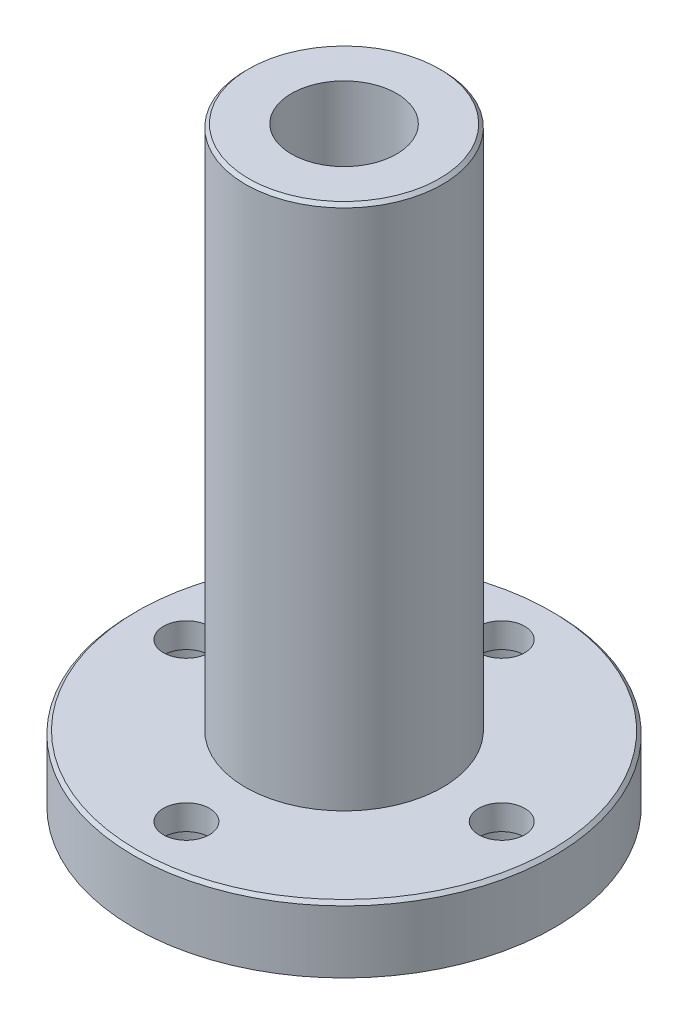
ISO-10303-21;
HEADER;
FILE_DESCRIPTION(('STEP AP214'),'2;1');
FILE_NAME('part.step','',(''),(''),'','','');
FILE_SCHEMA(('AUTOMOTIVE_DESIGN { 1 0 10303 214 1 1 1 1 }'));
ENDSEC;
DATA;
#1=APPLICATION_CONTEXT('core data for automotive mechanical design processes');
#2=APPLICATION_PROTOCOL_DEFINITION('international standard','automotive_design',2000,#1);
#3=PRODUCT_CONTEXT('',#1,'mechanical');
#4=PRODUCT('Part','Part','',(#3));
#5=PRODUCT_RELATED_PRODUCT_CATEGORY('part','',(#4));
#6=PRODUCT_DEFINITION_FORMATION('','',#4);
#7=PRODUCT_DEFINITION_CONTEXT('part definition',#1,'design');
#8=PRODUCT_DEFINITION('design','',#6,#7);
#9=PRODUCT_DEFINITION_SHAPE('','',#8);
#10=(LENGTH_UNIT() NAMED_UNIT(*) SI_UNIT(.MILLI.,.METRE.));
#11=(NAMED_UNIT(*) PLANE_ANGLE_UNIT() SI_UNIT($,.RADIAN.));
#12=(NAMED_UNIT(*) SI_UNIT($,.STERADIAN.) SOLID_ANGLE_UNIT());
#13=UNCERTAINTY_MEASURE_WITH_UNIT(LENGTH_MEASURE(1.E-05),#10,'distance_accuracy_value','');
#14=(GEOMETRIC_REPRESENTATION_CONTEXT(3) GLOBAL_UNCERTAINTY_ASSIGNED_CONTEXT((#13)) GLOBAL_UNIT_ASSIGNED_CONTEXT((#10,
#11,#12)) REPRESENTATION_CONTEXT('',''));
#15=CARTESIAN_POINT('',(0.,0.,0.));
#16=DIRECTION('',(0.,0.,1.));
#17=DIRECTION('',(1.,0.,0.));
#18=AXIS2_PLACEMENT_3D('',#15,#16,#17);
#19=CARTESIAN_POINT('',(0.,0.,-12.));
#20=DIRECTION('',(0.,1.,0.));
#21=DIRECTION('',(0.,0.,1.));
#22=AXIS2_PLACEMENT_3D('',#19,#20,#21);
#23=CYLINDRICAL_SURFACE('',#22,1.75);
#24=CARTESIAN_POINT('',(0.,5.,-12.));
#25=DIRECTION('',(0.,1.,0.));
#26=DIRECTION('',(0.,0.,1.));
#27=AXIS2_PLACEMENT_3D('',#24,#25,#26);
#28=CIRCLE('',#27,1.75);
#29=CARTESIAN_POINT('',(0.,5.,-10.25));
#30=VERTEX_POINT('',#29);
#31=EDGE_CURVE('E73',#30,#30,#28,.T.);
#32=ORIENTED_EDGE('',*,*,#31,.T.);
#33=EDGE_LOOP('',(#32));
#34=FACE_BOUND('',#33,.T.);
#35=CARTESIAN_POINT('',(0.,3.1,-12.));
#36=DIRECTION('',(0.,-1.,0.));
#37=DIRECTION('',(0.,0.,-1.));
#38=AXIS2_PLACEMENT_3D('',#35,#36,#37);
#39=CIRCLE('',#38,1.75);
#40=CARTESIAN_POINT('',(0.,3.1,-13.75));
#41=VERTEX_POINT('',#40);
#42=EDGE_CURVE('E52',#41,#41,#39,.F.);
#43=ORIENTED_EDGE('',*,*,#42,.F.);
#44=EDGE_LOOP('',(#43));
#45=FACE_BOUND('',#44,.T.);
#46=ADVANCED_FACE('F31',(#34,#45),#23,.F.);
#47=CARTESIAN_POINT('',(12.,0.,0.));
#48=DIRECTION('',(0.,1.,0.));
#49=DIRECTION('',(0.,0.,1.));
#50=AXIS2_PLACEMENT_3D('',#47,#48,#49);
#51=CYLINDRICAL_SURFACE('',#50,1.75);
#52=CARTESIAN_POINT('',(12.,5.,0.));
#53=DIRECTION('',(0.,1.,0.));
#54=DIRECTION('',(0.,0.,1.));
#55=AXIS2_PLACEMENT_3D('',#52,#53,#54);
#56=CIRCLE('',#55,1.75);
#57=CARTESIAN_POINT('',(12.,5.,1.75));
#58=VERTEX_POINT('',#57);
#59=EDGE_CURVE('E80',#58,#58,#56,.T.);
#60=ORIENTED_EDGE('',*,*,#59,.T.);
#61=EDGE_LOOP('',(#60));
#62=FACE_BOUND('',#61,.T.);
#63=CARTESIAN_POINT('',(12.,3.1,0.));
#64=DIRECTION('',(0.,-1.,0.));
#65=DIRECTION('',(0.,0.,-1.));
#66=AXIS2_PLACEMENT_3D('',#63,#64,#65);
#67=CIRCLE('',#66,1.75);
#68=CARTESIAN_POINT('',(12.,3.1,-1.75));
#69=VERTEX_POINT('',#68);
#70=EDGE_CURVE('E56',#69,#69,#67,.F.);
#71=ORIENTED_EDGE('',*,*,#70,.F.);
#72=EDGE_LOOP('',(#71));
#73=FACE_BOUND('',#72,.T.);
#74=ADVANCED_FACE('F153',(#62,#73),#51,.F.);
#75=CARTESIAN_POINT('',(-12.,0.,0.));
#76=DIRECTION('',(0.,1.,0.));
#77=DIRECTION('',(0.,0.,1.));
#78=AXIS2_PLACEMENT_3D('',#75,#76,#77);
#79=CYLINDRICAL_SURFACE('',#78,1.75);
#80=CARTESIAN_POINT('',(-12.,5.,0.));
#81=DIRECTION('',(0.,1.,0.));
#82=DIRECTION('',(0.,0.,1.));
#83=AXIS2_PLACEMENT_3D('',#80,#81,#82);
#84=CIRCLE('',#83,1.75);
#85=CARTESIAN_POINT('',(-12.,5.,1.75));
#86=VERTEX_POINT('',#85);
#87=EDGE_CURVE('E76',#86,#86,#84,.T.);
#88=ORIENTED_EDGE('',*,*,#87,.T.);
#89=EDGE_LOOP('',(#88));
#90=FACE_BOUND('',#89,.T.);
#91=CARTESIAN_POINT('',(-12.,3.1,0.));
#92=DIRECTION('',(0.,-1.,0.));
#93=DIRECTION('',(0.,0.,-1.));
#94=AXIS2_PLACEMENT_3D('',#91,#92,#93);
#95=CIRCLE('',#94,1.75);
#96=CARTESIAN_POINT('',(-12.,3.1,-1.75));
#97=VERTEX_POINT('',#96);
#98=EDGE_CURVE('E59',#97,#97,#95,.F.);
#99=ORIENTED_EDGE('',*,*,#98,.F.);
#100=EDGE_LOOP('',(#99));
#101=FACE_BOUND('',#100,.T.);
#102=ADVANCED_FACE('F149',(#90,#101),#79,.F.);
#103=CARTESIAN_POINT('',(0.,0.,12.));
#104=DIRECTION('',(0.,1.,0.));
#105=DIRECTION('',(0.,0.,1.));
#106=AXIS2_PLACEMENT_3D('',#103,#104,#105);
#107=CYLINDRICAL_SURFACE('',#106,1.75);
#108=CARTESIAN_POINT('',(0.,5.,12.));
#109=DIRECTION('',(0.,1.,0.));
#110=DIRECTION('',(0.,0.,1.));
#111=AXIS2_PLACEMENT_3D('',#108,#109,#110);
#112=CIRCLE('',#111,1.75);
#113=CARTESIAN_POINT('',(0.,5.,13.75));
#114=VERTEX_POINT('',#113);
#115=EDGE_CURVE('E77',#114,#114,#112,.T.);
#116=ORIENTED_EDGE('',*,*,#115,.T.);
#117=EDGE_LOOP('',(#116));
#118=FACE_BOUND('',#117,.T.);
#119=CARTESIAN_POINT('',(0.,3.1,12.));
#120=DIRECTION('',(0.,-1.,0.));
#121=DIRECTION('',(0.,0.,-1.));
#122=AXIS2_PLACEMENT_3D('',#119,#120,#121);
#123=CIRCLE('',#122,1.75);
#124=CARTESIAN_POINT('',(0.,3.1,10.25));
#125=VERTEX_POINT('',#124);
#126=EDGE_CURVE('E63',#125,#125,#123,.F.);
#127=ORIENTED_EDGE('',*,*,#126,.F.);
#128=EDGE_LOOP('',(#127));
#129=FACE_BOUND('',#128,.T.);
#130=ADVANCED_FACE('F140',(#118,#129),#107,.F.);
#131=CARTESIAN_POINT('',(0.,5.,0.));
#132=DIRECTION('',(0.,-1.,0.));
#133=DIRECTION('',(0.,0.,-1.));
#134=AXIS2_PLACEMENT_3D('',#131,#132,#133);
#135=CYLINDRICAL_SURFACE('',#134,16.);
#136=CARTESIAN_POINT('',(0.,4.75000000000001,0.));
#137=DIRECTION('',(0.,1.,0.));
#138=DIRECTION('',(0.,0.,1.));
#139=AXIS2_PLACEMENT_3D('',#136,#137,#138);
#140=CIRCLE('',#139,16.);
#141=CARTESIAN_POINT('',(0.,4.75000000000001,16.));
#142=VERTEX_POINT('',#141);
#143=EDGE_CURVE('E42',#142,#142,#140,.F.);
#144=ORIENTED_EDGE('',*,*,#143,.T.);
#145=EDGE_LOOP('',(#144));
#146=FACE_BOUND('',#145,.T.);
#147=CARTESIAN_POINT('',(0.,0.,0.));
#148=DIRECTION('',(0.,1.,0.));
#149=DIRECTION('',(0.,0.,1.));
#150=AXIS2_PLACEMENT_3D('',#147,#148,#149);
#151=CIRCLE('',#150,16.);
#152=CARTESIAN_POINT('',(0.,0.,16.));
#153=VERTEX_POINT('',#152);
#154=EDGE_CURVE('E51',#153,#153,#151,.T.);
#155=ORIENTED_EDGE('',*,*,#154,.T.);
#156=EDGE_LOOP('',(#155));
#157=FACE_BOUND('',#156,.T.);
#158=ADVANCED_FACE('F138',(#146,#157),#135,.T.);
#159=CARTESIAN_POINT('',(0.,5.,0.));
#160=DIRECTION('',(0.,1.,0.));
#161=DIRECTION('',(0.,0.,1.));
#162=AXIS2_PLACEMENT_3D('',#159,#160,#161);
#163=PLANE('',#162);
#164=CARTESIAN_POINT('',(0.,5.,0.));
#165=DIRECTION('',(0.,1.,0.));
#166=DIRECTION('',(0.,0.,1.));
#167=AXIS2_PLACEMENT_3D('',#164,#165,#166);
#168=CIRCLE('',#167,15.75);
#169=CARTESIAN_POINT('',(0.,5.,15.75));
#170=VERTEX_POINT('',#169);
#171=EDGE_CURVE('E46',#170,#170,#168,.T.);
#172=ORIENTED_EDGE('',*,*,#171,.T.);
#173=EDGE_LOOP('',(#172));
#174=FACE_BOUND('',#173,.T.);
#175=ORIENTED_EDGE('',*,*,#87,.F.);
#176=EDGE_LOOP('',(#175));
#177=FACE_BOUND('',#176,.T.);
#178=ORIENTED_EDGE('',*,*,#59,.F.);
#179=EDGE_LOOP('',(#178));
#180=FACE_BOUND('',#179,.T.);
#181=ORIENTED_EDGE('',*,*,#115,.F.);
#182=EDGE_LOOP('',(#181));
#183=FACE_BOUND('',#182,.T.);
#184=ORIENTED_EDGE('',*,*,#31,.F.);
#185=EDGE_LOOP('',(#184));
#186=FACE_BOUND('',#185,.T.);
#187=CARTESIAN_POINT('',(0.,5.,0.));
#188=DIRECTION('',(0.,1.,0.));
#189=DIRECTION('',(0.,0.,1.));
#190=AXIS2_PLACEMENT_3D('',#187,#188,#189);
#191=CIRCLE('',#190,7.5);
#192=CARTESIAN_POINT('',(0.,5.,7.5));
#193=VERTEX_POINT('',#192);
#194=EDGE_CURVE('E70',#193,#193,#191,.T.);
#195=ORIENTED_EDGE('',*,*,#194,.F.);
#196=EDGE_LOOP('',(#195));
#197=FACE_BOUND('',#196,.T.);
#198=ADVANCED_FACE('F126',(#174,#177,#180,#183,#186,#197),#163,.T.);
#199=CARTESIAN_POINT('',(0.,0.,0.));
#200=DIRECTION('',(0.,1.,0.));
#201=DIRECTION('',(0.,0.,1.));
#202=AXIS2_PLACEMENT_3D('',#199,#200,#201);
#203=PLANE('',#202);
#204=CARTESIAN_POINT('',(-12.,0.,0.));
#205=DIRECTION('',(0.,-1.,0.));
#206=DIRECTION('',(0.,0.,-1.));
#207=AXIS2_PLACEMENT_3D('',#204,#205,#206);
#208=CIRCLE('',#207,3.);
#209=CARTESIAN_POINT('',(-12.,0.,-3.));
#210=VERTEX_POINT('',#209);
#211=EDGE_CURVE('E106',#210,#210,#208,.T.);
#212=ORIENTED_EDGE('',*,*,#211,.F.);
#213=EDGE_LOOP('',(#212));
#214=FACE_BOUND('',#213,.T.);
#215=CARTESIAN_POINT('',(0.,0.,-12.));
#216=DIRECTION('',(0.,-1.,0.));
#217=DIRECTION('',(0.,0.,-1.));
#218=AXIS2_PLACEMENT_3D('',#215,#216,#217);
#219=CIRCLE('',#218,3.);
#220=CARTESIAN_POINT('',(0.,0.,-15.));
#221=VERTEX_POINT('',#220);
#222=EDGE_CURVE('E100',#221,#221,#219,.T.);
#223=ORIENTED_EDGE('',*,*,#222,.F.);
#224=EDGE_LOOP('',(#223));
#225=FACE_BOUND('',#224,.T.);
#226=CARTESIAN_POINT('',(12.,0.,0.));
#227=DIRECTION('',(0.,-1.,0.));
#228=DIRECTION('',(0.,0.,-1.));
#229=AXIS2_PLACEMENT_3D('',#226,#227,#228);
#230=CIRCLE('',#229,3.);
#231=CARTESIAN_POINT('',(12.,0.,-3.));
#232=VERTEX_POINT('',#231);
#233=EDGE_CURVE('E94',#232,#232,#230,.T.);
#234=ORIENTED_EDGE('',*,*,#233,.F.);
#235=EDGE_LOOP('',(#234));
#236=FACE_BOUND('',#235,.T.);
#237=CARTESIAN_POINT('',(0.,0.,12.));
#238=DIRECTION('',(0.,-1.,0.));
#239=DIRECTION('',(0.,0.,-1.));
#240=AXIS2_PLACEMENT_3D('',#237,#238,#239);
#241=CIRCLE('',#240,3.);
#242=CARTESIAN_POINT('',(0.,0.,9.));
#243=VERTEX_POINT('',#242);
#244=EDGE_CURVE('E55',#243,#243,#241,.T.);
#245=ORIENTED_EDGE('',*,*,#244,.F.);
#246=EDGE_LOOP('',(#245));
#247=FACE_BOUND('',#246,.T.);
#248=CARTESIAN_POINT('',(0.,0.,0.));
#249=DIRECTION('',(0.,1.,0.));
#250=DIRECTION('',(0.,0.,1.));
#251=AXIS2_PLACEMENT_3D('',#248,#249,#250);
#252=CIRCLE('',#251,4.);
#253=CARTESIAN_POINT('',(0.,0.,4.));
#254=VERTEX_POINT('',#253);
#255=EDGE_CURVE('E81',#254,#254,#252,.F.);
#256=ORIENTED_EDGE('',*,*,#255,.F.);
#257=EDGE_LOOP('',(#256));
#258=FACE_BOUND('',#257,.T.);
#259=ORIENTED_EDGE('',*,*,#154,.F.);
#260=EDGE_LOOP('',(#259));
#261=FACE_BOUND('',#260,.T.);
#262=ADVANCED_FACE('F122',(#214,#225,#236,#247,#258,#261),#203,.F.);
#263=CARTESIAN_POINT('',(0.,45.,0.));
#264=DIRECTION('',(0.,-1.,0.));
#265=DIRECTION('',(0.,0.,-1.));
#266=AXIS2_PLACEMENT_3D('',#263,#264,#265);
#267=CYLINDRICAL_SURFACE('',#266,7.5);
#268=CARTESIAN_POINT('',(0.,44.75,0.));
#269=DIRECTION('',(0.,1.,0.));
#270=DIRECTION('',(0.,0.,1.));
#271=AXIS2_PLACEMENT_3D('',#268,#269,#270);
#272=CIRCLE('',#271,7.5);
#273=CARTESIAN_POINT('',(0.,44.75,7.5));
#274=VERTEX_POINT('',#273);
#275=EDGE_CURVE('E10',#274,#274,#272,.F.);
#276=ORIENTED_EDGE('',*,*,#275,.T.);
#277=EDGE_LOOP('',(#276));
#278=FACE_BOUND('',#277,.T.);
#279=ORIENTED_EDGE('',*,*,#194,.T.);
#280=EDGE_LOOP('',(#279));
#281=FACE_BOUND('',#280,.T.);
#282=ADVANCED_FACE('F125',(#278,#281),#267,.T.);
#283=CARTESIAN_POINT('',(0.,45.,0.));
#284=DIRECTION('',(0.,1.,0.));
#285=DIRECTION('',(0.,0.,1.));
#286=AXIS2_PLACEMENT_3D('',#283,#284,#285);
#287=PLANE('',#286);
#288=CARTESIAN_POINT('',(0.,45.,0.));
#289=DIRECTION('',(0.,1.,0.));
#290=DIRECTION('',(0.,0.,1.));
#291=AXIS2_PLACEMENT_3D('',#288,#289,#290);
#292=CIRCLE('',#291,7.25);
#293=CARTESIAN_POINT('',(0.,45.,7.25));
#294=VERTEX_POINT('',#293);
#295=EDGE_CURVE('E38',#294,#294,#292,.T.);
#296=ORIENTED_EDGE('',*,*,#295,.T.);
#297=EDGE_LOOP('',(#296));
#298=FACE_BOUND('',#297,.T.);
#299=CARTESIAN_POINT('',(0.,45.,0.));
#300=DIRECTION('',(0.,1.,0.));
#301=DIRECTION('',(0.,0.,1.));
#302=AXIS2_PLACEMENT_3D('',#299,#300,#301);
#303=CIRCLE('',#302,4.);
#304=CARTESIAN_POINT('',(0.,45.,4.));
#305=VERTEX_POINT('',#304);
#306=EDGE_CURVE('E66',#305,#305,#303,.T.);
#307=ORIENTED_EDGE('',*,*,#306,.F.);
#308=EDGE_LOOP('',(#307));
#309=FACE_BOUND('',#308,.T.);
#310=ADVANCED_FACE('F163',(#298,#309),#287,.T.);
#311=CARTESIAN_POINT('',(0.,-11.3137084989848,0.));
#312=DIRECTION('',(0.,1.,0.));
#313=DIRECTION('',(0.,0.,1.));
#314=AXIS2_PLACEMENT_3D('',#311,#312,#313);
#315=CYLINDRICAL_SURFACE('',#314,4.);
#316=ORIENTED_EDGE('',*,*,#255,.T.);
#317=EDGE_LOOP('',(#316));
#318=FACE_BOUND('',#317,.T.);
#319=ORIENTED_EDGE('',*,*,#306,.T.);
#320=EDGE_LOOP('',(#319));
#321=FACE_BOUND('',#320,.T.);
#322=ADVANCED_FACE('F166',(#318,#321),#315,.F.);
#323=CARTESIAN_POINT('',(0.,3.1,12.));
#324=DIRECTION('',(0.,-1.,0.));
#325=DIRECTION('',(0.,0.,-1.));
#326=AXIS2_PLACEMENT_3D('',#323,#324,#325);
#327=PLANE('',#326);
#328=CARTESIAN_POINT('',(0.,3.1,12.));
#329=DIRECTION('',(0.,-1.,0.));
#330=DIRECTION('',(0.,0.,-1.));
#331=AXIS2_PLACEMENT_3D('',#328,#329,#330);
#332=CIRCLE('',#331,3.);
#333=CARTESIAN_POINT('',(0.,3.1,9.));
#334=VERTEX_POINT('',#333);
#335=EDGE_CURVE('E67',#334,#334,#332,.T.);
#336=ORIENTED_EDGE('',*,*,#335,.T.);
#337=EDGE_LOOP('',(#336));
#338=FACE_BOUND('',#337,.T.);
#339=ORIENTED_EDGE('',*,*,#126,.T.);
#340=EDGE_LOOP('',(#339));
#341=FACE_BOUND('',#340,.T.);
#342=ADVANCED_FACE('F187',(#338,#341),#327,.T.);
#343=CARTESIAN_POINT('',(0.,3.1,12.));
#344=DIRECTION('',(0.,-1.,0.));
#345=DIRECTION('',(0.,0.,-1.));
#346=AXIS2_PLACEMENT_3D('',#343,#344,#345);
#347=CYLINDRICAL_SURFACE('',#346,3.);
#348=ORIENTED_EDGE('',*,*,#335,.F.);
#349=EDGE_LOOP('',(#348));
#350=FACE_BOUND('',#349,.T.);
#351=ORIENTED_EDGE('',*,*,#244,.T.);
#352=EDGE_LOOP('',(#351));
#353=FACE_BOUND('',#352,.T.);
#354=ADVANCED_FACE('F195',(#350,#353),#347,.F.);
#355=CARTESIAN_POINT('',(-12.,3.1,0.));
#356=DIRECTION('',(0.,-1.,0.));
#357=DIRECTION('',(0.,0.,-1.));
#358=AXIS2_PLACEMENT_3D('',#355,#356,#357);
#359=PLANE('',#358);
#360=CARTESIAN_POINT('',(-12.,3.1,0.));
#361=DIRECTION('',(0.,-1.,0.));
#362=DIRECTION('',(0.,0.,-1.));
#363=AXIS2_PLACEMENT_3D('',#360,#361,#362);
#364=CIRCLE('',#363,3.);
#365=CARTESIAN_POINT('',(-12.,3.1,-3.));
#366=VERTEX_POINT('',#365);
#367=EDGE_CURVE('E62',#366,#366,#364,.T.);
#368=ORIENTED_EDGE('',*,*,#367,.T.);
#369=EDGE_LOOP('',(#368));
#370=FACE_BOUND('',#369,.T.);
#371=ORIENTED_EDGE('',*,*,#98,.T.);
#372=EDGE_LOOP('',(#371));
#373=FACE_BOUND('',#372,.T.);
#374=ADVANCED_FACE('F112',(#370,#373),#359,.T.);
#375=CARTESIAN_POINT('',(-12.,3.1,0.));
#376=DIRECTION('',(0.,-1.,0.));
#377=DIRECTION('',(0.,0.,-1.));
#378=AXIS2_PLACEMENT_3D('',#375,#376,#377);
#379=CYLINDRICAL_SURFACE('',#378,3.);
#380=ORIENTED_EDGE('',*,*,#367,.F.);
#381=EDGE_LOOP('',(#380));
#382=FACE_BOUND('',#381,.T.);
#383=ORIENTED_EDGE('',*,*,#211,.T.);
#384=EDGE_LOOP('',(#383));
#385=FACE_BOUND('',#384,.T.);
#386=ADVANCED_FACE('F115',(#382,#385),#379,.F.);
#387=CARTESIAN_POINT('',(12.,3.1,0.));
#388=DIRECTION('',(0.,-1.,0.));
#389=DIRECTION('',(0.,0.,-1.));
#390=AXIS2_PLACEMENT_3D('',#387,#388,#389);
#391=PLANE('',#390);
#392=CARTESIAN_POINT('',(12.,3.1,0.));
#393=DIRECTION('',(0.,-1.,0.));
#394=DIRECTION('',(0.,0.,-1.));
#395=AXIS2_PLACEMENT_3D('',#392,#393,#394);
#396=CIRCLE('',#395,3.);
#397=CARTESIAN_POINT('',(12.,3.1,-3.));
#398=VERTEX_POINT('',#397);
#399=EDGE_CURVE('E97',#398,#398,#396,.T.);
#400=ORIENTED_EDGE('',*,*,#399,.T.);
#401=EDGE_LOOP('',(#400));
#402=FACE_BOUND('',#401,.T.);
#403=ORIENTED_EDGE('',*,*,#70,.T.);
#404=EDGE_LOOP('',(#403));
#405=FACE_BOUND('',#404,.T.);
#406=ADVANCED_FACE('F118',(#402,#405),#391,.T.);
#407=CARTESIAN_POINT('',(12.,3.1,0.));
#408=DIRECTION('',(0.,-1.,0.));
#409=DIRECTION('',(0.,0.,-1.));
#410=AXIS2_PLACEMENT_3D('',#407,#408,#409);
#411=CYLINDRICAL_SURFACE('',#410,3.);
#412=ORIENTED_EDGE('',*,*,#399,.F.);
#413=EDGE_LOOP('',(#412));
#414=FACE_BOUND('',#413,.T.);
#415=ORIENTED_EDGE('',*,*,#233,.T.);
#416=EDGE_LOOP('',(#415));
#417=FACE_BOUND('',#416,.T.);
#418=ADVANCED_FACE('F220',(#414,#417),#411,.F.);
#419=CARTESIAN_POINT('',(0.,3.1,-12.));
#420=DIRECTION('',(0.,-1.,0.));
#421=DIRECTION('',(0.,0.,-1.));
#422=AXIS2_PLACEMENT_3D('',#419,#420,#421);
#423=PLANE('',#422);
#424=CARTESIAN_POINT('',(0.,3.1,-12.));
#425=DIRECTION('',(0.,-1.,0.));
#426=DIRECTION('',(0.,0.,-1.));
#427=AXIS2_PLACEMENT_3D('',#424,#425,#426);
#428=CIRCLE('',#427,3.);
#429=CARTESIAN_POINT('',(0.,3.1,-15.));
#430=VERTEX_POINT('',#429);
#431=EDGE_CURVE('E103',#430,#430,#428,.T.);
#432=ORIENTED_EDGE('',*,*,#431,.T.);
#433=EDGE_LOOP('',(#432));
#434=FACE_BOUND('',#433,.T.);
#435=ORIENTED_EDGE('',*,*,#42,.T.);
#436=EDGE_LOOP('',(#435));
#437=FACE_BOUND('',#436,.T.);
#438=ADVANCED_FACE('F228',(#434,#437),#423,.T.);
#439=CARTESIAN_POINT('',(0.,3.1,-12.));
#440=DIRECTION('',(0.,-1.,0.));
#441=DIRECTION('',(0.,0.,-1.));
#442=AXIS2_PLACEMENT_3D('',#439,#440,#441);
#443=CYLINDRICAL_SURFACE('',#442,3.);
#444=ORIENTED_EDGE('',*,*,#431,.F.);
#445=EDGE_LOOP('',(#444));
#446=FACE_BOUND('',#445,.T.);
#447=ORIENTED_EDGE('',*,*,#222,.T.);
#448=EDGE_LOOP('',(#447));
#449=FACE_BOUND('',#448,.T.);
#450=ADVANCED_FACE('F236',(#446,#449),#443,.F.);
#451=CARTESIAN_POINT('',(0.,5.,0.));
#452=DIRECTION('',(0.,-1.,0.));
#453=DIRECTION('',(0.,0.,-1.));
#454=AXIS2_PLACEMENT_3D('',#451,#452,#453);
#455=CONICAL_SURFACE('',#454,15.75,0.785398163397462);
#456=ORIENTED_EDGE('',*,*,#143,.F.);
#457=EDGE_LOOP('',(#456));
#458=FACE_BOUND('',#457,.T.);
#459=ORIENTED_EDGE('',*,*,#171,.F.);
#460=EDGE_LOOP('',(#459));
#461=FACE_BOUND('',#460,.T.);
#462=ADVANCED_FACE('F244',(#458,#461),#455,.T.);
#463=CARTESIAN_POINT('',(0.,45.,0.));
#464=DIRECTION('',(0.,-1.,0.));
#465=DIRECTION('',(0.,0.,-1.));
#466=AXIS2_PLACEMENT_3D('',#463,#464,#465);
#467=CONICAL_SURFACE('',#466,7.25,0.78539816339745);
#468=ORIENTED_EDGE('',*,*,#275,.F.);
#469=EDGE_LOOP('',(#468));
#470=FACE_BOUND('',#469,.T.);
#471=ORIENTED_EDGE('',*,*,#295,.F.);
#472=EDGE_LOOP('',(#471));
#473=FACE_BOUND('',#472,.T.);
#474=ADVANCED_FACE('F33',(#470,#473),#467,.T.);
#475=CLOSED_SHELL('',(#46,#74,#102,#130,#158,#198,#262,#282,#310,#322,#342,#354,#374,#386,#406,
#418,#438,#450,#462,#474));
#476=MANIFOLD_SOLID_BREP('B2',#475);
#477=ADVANCED_BREP_SHAPE_REPRESENTATION('',(#18,#476),#14);
#478=SHAPE_DEFINITION_REPRESENTATION(#9,#477);
ENDSEC;
END-ISO-10303-21;
